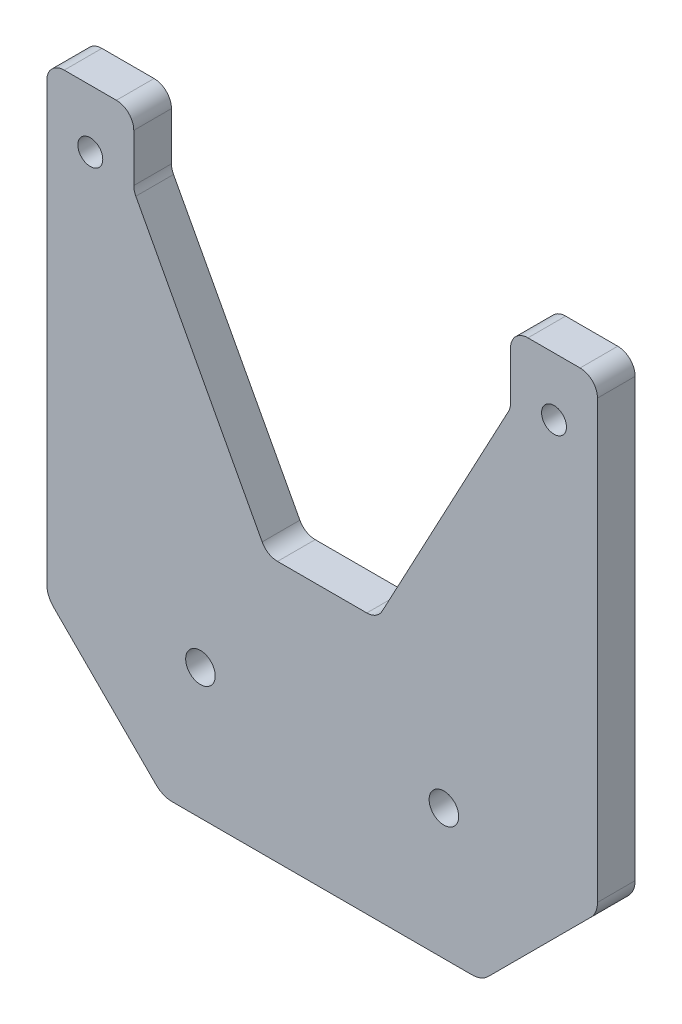
ISO-10303-21;
HEADER;
FILE_DESCRIPTION(('STEP AP214'),'2;1');
FILE_NAME('part.step','',(''),(''),'','','');
FILE_SCHEMA(('AUTOMOTIVE_DESIGN { 1 0 10303 214 1 1 1 1 }'));
ENDSEC;
DATA;
#1=APPLICATION_CONTEXT('core data for automotive mechanical design processes');
#2=APPLICATION_PROTOCOL_DEFINITION('international standard','automotive_design',2000,#1);
#3=PRODUCT_CONTEXT('',#1,'mechanical');
#4=PRODUCT('Part','Part','',(#3));
#5=PRODUCT_RELATED_PRODUCT_CATEGORY('part','',(#4));
#6=PRODUCT_DEFINITION_FORMATION('','',#4);
#7=PRODUCT_DEFINITION_CONTEXT('part definition',#1,'design');
#8=PRODUCT_DEFINITION('design','',#6,#7);
#9=PRODUCT_DEFINITION_SHAPE('','',#8);
#10=(LENGTH_UNIT() NAMED_UNIT(*) SI_UNIT(.MILLI.,.METRE.));
#11=(NAMED_UNIT(*) PLANE_ANGLE_UNIT() SI_UNIT($,.RADIAN.));
#12=(NAMED_UNIT(*) SI_UNIT($,.STERADIAN.) SOLID_ANGLE_UNIT());
#13=UNCERTAINTY_MEASURE_WITH_UNIT(LENGTH_MEASURE(1.E-05),#10,'distance_accuracy_value','');
#14=(GEOMETRIC_REPRESENTATION_CONTEXT(3) GLOBAL_UNCERTAINTY_ASSIGNED_CONTEXT((#13)) GLOBAL_UNIT_ASSIGNED_CONTEXT((#10,
#11,#12)) REPRESENTATION_CONTEXT('',''));
#15=CARTESIAN_POINT('',(0.,0.,0.));
#16=DIRECTION('',(0.,0.,1.));
#17=DIRECTION('',(1.,0.,0.));
#18=AXIS2_PLACEMENT_3D('',#15,#16,#17);
#19=CARTESIAN_POINT('',(0.,0.,6.5));
#20=DIRECTION('',(0.,1.,0.));
#21=DIRECTION('',(-1.,0.,0.));
#22=AXIS2_PLACEMENT_3D('',#19,#20,#21);
#23=PLANE('',#22);
#24=DIRECTION('',(1.,0.,0.));
#25=VECTOR('',#24,1.);
#26=CARTESIAN_POINT('',(0.,0.,6.5));
#27=LINE('',#26,#25);
#28=CARTESIAN_POINT('',(-7.70245990505025,0.,6.5));
#29=VERTEX_POINT('',#28);
#30=CARTESIAN_POINT('',(7.70245990505026,0.,6.5));
#31=VERTEX_POINT('',#30);
#32=EDGE_CURVE('E374',#29,#31,#27,.T.);
#33=ORIENTED_EDGE('',*,*,#32,.T.);
#34=DIRECTION('',(0.,0.,-1.));
#35=VECTOR('',#34,1.);
#36=CARTESIAN_POINT('',(7.70245990505026,0.,6.5));
#37=LINE('',#36,#35);
#38=CARTESIAN_POINT('',(7.70245990505026,0.,0.));
#39=VERTEX_POINT('',#38);
#40=EDGE_CURVE('E223',#31,#39,#37,.T.);
#41=ORIENTED_EDGE('',*,*,#40,.T.);
#42=DIRECTION('',(1.,0.,0.));
#43=VECTOR('',#42,1.);
#44=CARTESIAN_POINT('',(0.,0.,0.));
#45=LINE('',#44,#43);
#46=CARTESIAN_POINT('',(-7.70245990505025,0.,0.));
#47=VERTEX_POINT('',#46);
#48=EDGE_CURVE('E207',#47,#39,#45,.T.);
#49=ORIENTED_EDGE('',*,*,#48,.F.);
#50=DIRECTION('',(0.,0.,-1.));
#51=VECTOR('',#50,1.);
#52=CARTESIAN_POINT('',(-7.70245990505025,0.,6.5));
#53=LINE('',#52,#51);
#54=EDGE_CURVE('E220',#47,#29,#53,.F.);
#55=ORIENTED_EDGE('',*,*,#54,.T.);
#56=EDGE_LOOP('',(#33,#41,#49,#55));
#57=FACE_BOUND('',#56,.T.);
#58=ADVANCED_FACE('F39',(#57),#23,.T.);
#59=CARTESIAN_POINT('',(-7.38666947014298,-3.95100925147183,6.5));
#60=DIRECTION('',(0.881784641934691,0.471652250337161,0.));
#61=DIRECTION('',(-0.471652250337161,0.881784641934691,0.));
#62=AXIS2_PLACEMENT_3D('',#59,#60,#61);
#63=PLANE('',#62);
#64=DIRECTION('',(0.471652250337161,-0.881784641934692,0.));
#65=VECTOR('',#64,1.);
#66=CARTESIAN_POINT('',(-7.38666947014298,-3.95100925147183,0.));
#67=LINE('',#66,#65);
#68=CARTESIAN_POINT('',(-32.1453539258041,42.3369660351989,0.));
#69=VERTEX_POINT('',#68);
#70=CARTESIAN_POINT('',(-10.3478138308543,1.58504324898852,0.));
#71=VERTEX_POINT('',#70);
#72=EDGE_CURVE('E209',#69,#71,#67,.T.);
#73=ORIENTED_EDGE('',*,*,#72,.F.);
#74=DIRECTION('',(0.,0.,-1.));
#75=VECTOR('',#74,1.);
#76=CARTESIAN_POINT('',(-32.1453539258041,42.3369660351989,6.5));
#77=LINE('',#76,#75);
#78=CARTESIAN_POINT('',(-32.1453539258041,42.3369660351989,6.5));
#79=VERTEX_POINT('',#78);
#80=EDGE_CURVE('E277',#69,#79,#77,.F.);
#81=ORIENTED_EDGE('',*,*,#80,.T.);
#82=DIRECTION('',(0.471652250337161,-0.881784641934692,0.));
#83=VECTOR('',#82,1.);
#84=CARTESIAN_POINT('',(-7.38666947014298,-3.95100925147183,6.5));
#85=LINE('',#84,#83);
#86=CARTESIAN_POINT('',(-10.3478138308543,1.58504324898852,6.5));
#87=VERTEX_POINT('',#86);
#88=EDGE_CURVE('E377',#79,#87,#85,.T.);
#89=ORIENTED_EDGE('',*,*,#88,.T.);
#90=DIRECTION('',(0.,0.,-1.));
#91=VECTOR('',#90,1.);
#92=CARTESIAN_POINT('',(-10.3478138308543,1.58504324898852,0.));
#93=LINE('',#92,#91);
#94=EDGE_CURVE('E275',#87,#71,#93,.T.);
#95=ORIENTED_EDGE('',*,*,#94,.T.);
#96=EDGE_LOOP('',(#73,#81,#89,#95));
#97=FACE_BOUND('',#96,.T.);
#98=ADVANCED_FACE('F456',(#97),#63,.T.);
#99=CARTESIAN_POINT('',(-32.5,0.,6.5));
#100=DIRECTION('',(1.,0.,0.));
#101=DIRECTION('',(0.,1.,0.));
#102=AXIS2_PLACEMENT_3D('',#99,#100,#101);
#103=PLANE('',#102);
#104=DIRECTION('',(0.,-1.,0.));
#105=VECTOR('',#104,1.);
#106=CARTESIAN_POINT('',(-32.5,0.,6.5));
#107=LINE('',#106,#105);
#108=CARTESIAN_POINT('',(-32.5,52.,6.5));
#109=VERTEX_POINT('',#108);
#110=CARTESIAN_POINT('',(-32.5,43.7519227862104,6.5));
#111=VERTEX_POINT('',#110);
#112=EDGE_CURVE('E380',#109,#111,#107,.T.);
#113=ORIENTED_EDGE('',*,*,#112,.T.);
#114=DIRECTION('',(0.,0.,-1.));
#115=VECTOR('',#114,1.);
#116=CARTESIAN_POINT('',(-32.5,43.7519227862104,0.));
#117=LINE('',#116,#115);
#118=CARTESIAN_POINT('',(-32.5,43.7519227862104,0.));
#119=VERTEX_POINT('',#118);
#120=EDGE_CURVE('E272',#111,#119,#117,.T.);
#121=ORIENTED_EDGE('',*,*,#120,.T.);
#122=DIRECTION('',(0.,-1.,0.));
#123=VECTOR('',#122,1.);
#124=CARTESIAN_POINT('',(-32.5,0.,0.));
#125=LINE('',#124,#123);
#126=CARTESIAN_POINT('',(-32.5,52.,0.));
#127=VERTEX_POINT('',#126);
#128=EDGE_CURVE('E413',#127,#119,#125,.T.);
#129=ORIENTED_EDGE('',*,*,#128,.F.);
#130=DIRECTION('',(0.,0.,-1.));
#131=VECTOR('',#130,1.);
#132=CARTESIAN_POINT('',(-32.5,52.,6.5));
#133=LINE('',#132,#131);
#134=EDGE_CURVE('E270',#127,#109,#133,.F.);
#135=ORIENTED_EDGE('',*,*,#134,.T.);
#136=EDGE_LOOP('',(#113,#121,#129,#135));
#137=FACE_BOUND('',#136,.T.);
#138=ADVANCED_FACE('F461',(#137),#103,.T.);
#139=CARTESIAN_POINT('',(0.,55.,6.5));
#140=DIRECTION('',(0.,-1.,0.));
#141=DIRECTION('',(1.,0.,0.));
#142=AXIS2_PLACEMENT_3D('',#139,#140,#141);
#143=PLANE('',#142);
#144=DIRECTION('',(-1.,0.,0.));
#145=VECTOR('',#144,1.);
#146=CARTESIAN_POINT('',(0.,55.,0.));
#147=LINE('',#146,#145);
#148=CARTESIAN_POINT('',(-35.5,55.,0.));
#149=VERTEX_POINT('',#148);
#150=CARTESIAN_POINT('',(-44.5,55.,0.));
#151=VERTEX_POINT('',#150);
#152=EDGE_CURVE('E416',#149,#151,#147,.T.);
#153=ORIENTED_EDGE('',*,*,#152,.T.);
#154=DIRECTION('',(0.,0.,-1.));
#155=VECTOR('',#154,1.);
#156=CARTESIAN_POINT('',(-44.5,55.,6.5));
#157=LINE('',#156,#155);
#158=CARTESIAN_POINT('',(-44.5,55.,6.5));
#159=VERTEX_POINT('',#158);
#160=EDGE_CURVE('E285',#151,#159,#157,.F.);
#161=ORIENTED_EDGE('',*,*,#160,.T.);
#162=DIRECTION('',(-1.,0.,0.));
#163=VECTOR('',#162,1.);
#164=CARTESIAN_POINT('',(0.,55.,6.5));
#165=LINE('',#164,#163);
#166=CARTESIAN_POINT('',(-35.5,55.,6.5));
#167=VERTEX_POINT('',#166);
#168=EDGE_CURVE('E385',#167,#159,#165,.T.);
#169=ORIENTED_EDGE('',*,*,#168,.F.);
#170=DIRECTION('',(0.,0.,-1.));
#171=VECTOR('',#170,1.);
#172=CARTESIAN_POINT('',(-35.5,55.,0.));
#173=LINE('',#172,#171);
#174=EDGE_CURVE('E282',#167,#149,#173,.T.);
#175=ORIENTED_EDGE('',*,*,#174,.T.);
#176=EDGE_LOOP('',(#153,#161,#169,#175));
#177=FACE_BOUND('',#176,.T.);
#178=ADVANCED_FACE('F628',(#177),#143,.F.);
#179=CARTESIAN_POINT('',(-47.5,0.,6.5));
#180=DIRECTION('',(1.,0.,0.));
#181=DIRECTION('',(0.,0.,-1.));
#182=AXIS2_PLACEMENT_3D('',#179,#180,#181);
#183=PLANE('',#182);
#184=DIRECTION('',(0.,-1.,0.));
#185=VECTOR('',#184,1.);
#186=CARTESIAN_POINT('',(-47.5,0.,0.));
#187=LINE('',#186,#185);
#188=CARTESIAN_POINT('',(-47.5,52.,0.));
#189=VERTEX_POINT('',#188);
#190=CARTESIAN_POINT('',(-47.5,-23.3431457505076,0.));
#191=VERTEX_POINT('',#190);
#192=EDGE_CURVE('E355',#189,#191,#187,.T.);
#193=ORIENTED_EDGE('',*,*,#192,.T.);
#194=DIRECTION('',(0.,0.,-1.));
#195=VECTOR('',#194,1.);
#196=CARTESIAN_POINT('',(-47.5,-23.3431457505076,6.5));
#197=LINE('',#196,#195);
#198=CARTESIAN_POINT('',(-47.5,-23.3431457505076,6.5));
#199=VERTEX_POINT('',#198);
#200=EDGE_CURVE('E11',#191,#199,#197,.F.);
#201=ORIENTED_EDGE('',*,*,#200,.T.);
#202=DIRECTION('',(0.,-1.,0.));
#203=VECTOR('',#202,1.);
#204=CARTESIAN_POINT('',(-47.5,0.,6.5));
#205=LINE('',#204,#203);
#206=CARTESIAN_POINT('',(-47.5,52.,6.5));
#207=VERTEX_POINT('',#206);
#208=EDGE_CURVE('E388',#207,#199,#205,.T.);
#209=ORIENTED_EDGE('',*,*,#208,.F.);
#210=DIRECTION('',(0.,0.,-1.));
#211=VECTOR('',#210,1.);
#212=CARTESIAN_POINT('',(-47.5,52.,6.5));
#213=LINE('',#212,#211);
#214=EDGE_CURVE('E279',#207,#189,#213,.T.);
#215=ORIENTED_EDGE('',*,*,#214,.T.);
#216=EDGE_LOOP('',(#193,#201,#209,#215));
#217=FACE_BOUND('',#216,.T.);
#218=ADVANCED_FACE('F421',(#217),#183,.F.);
#219=CARTESIAN_POINT('',(0.,-45.,6.5));
#220=DIRECTION('',(0.,1.,0.));
#221=DIRECTION('',(-1.,0.,0.));
#222=AXIS2_PLACEMENT_3D('',#219,#220,#221);
#223=PLANE('',#222);
#224=DIRECTION('',(1.,0.,0.));
#225=VECTOR('',#224,1.);
#226=CARTESIAN_POINT('',(0.,-45.,6.5));
#227=LINE('',#226,#225);
#228=CARTESIAN_POINT('',(-25.8431457505076,-45.,6.5));
#229=VERTEX_POINT('',#228);
#230=CARTESIAN_POINT('',(25.8431457505076,-45.,6.5));
#231=VERTEX_POINT('',#230);
#232=EDGE_CURVE('E391',#229,#231,#227,.T.);
#233=ORIENTED_EDGE('',*,*,#232,.F.);
#234=DIRECTION('',(0.,0.,1.));
#235=VECTOR('',#234,1.);
#236=CARTESIAN_POINT('',(-25.8431457505076,-45.,0.));
#237=LINE('',#236,#235);
#238=CARTESIAN_POINT('',(-25.8431457505076,-45.,0.));
#239=VERTEX_POINT('',#238);
#240=EDGE_CURVE('E313',#229,#239,#237,.F.);
#241=ORIENTED_EDGE('',*,*,#240,.T.);
#242=DIRECTION('',(1.,0.,0.));
#243=VECTOR('',#242,1.);
#244=CARTESIAN_POINT('',(0.,-45.,0.));
#245=LINE('',#244,#243);
#246=CARTESIAN_POINT('',(25.8431457505076,-45.,0.));
#247=VERTEX_POINT('',#246);
#248=EDGE_CURVE('E350',#239,#247,#245,.T.);
#249=ORIENTED_EDGE('',*,*,#248,.T.);
#250=DIRECTION('',(0.,0.,1.));
#251=VECTOR('',#250,1.);
#252=CARTESIAN_POINT('',(25.8431457505076,-45.,6.5));
#253=LINE('',#252,#251);
#254=EDGE_CURVE('E310',#247,#231,#253,.T.);
#255=ORIENTED_EDGE('',*,*,#254,.T.);
#256=EDGE_LOOP('',(#233,#241,#249,#255));
#257=FACE_BOUND('',#256,.T.);
#258=ADVANCED_FACE('F438',(#257),#223,.F.);
#259=CARTESIAN_POINT('',(47.5,0.,6.5));
#260=DIRECTION('',(1.,0.,0.));
#261=DIRECTION('',(0.,1.,0.));
#262=AXIS2_PLACEMENT_3D('',#259,#260,#261);
#263=PLANE('',#262);
#264=DIRECTION('',(0.,-1.,0.));
#265=VECTOR('',#264,1.);
#266=CARTESIAN_POINT('',(47.5,0.,6.5));
#267=LINE('',#266,#265);
#268=CARTESIAN_POINT('',(47.5,52.,6.5));
#269=VERTEX_POINT('',#268);
#270=CARTESIAN_POINT('',(47.5,-23.3431457505076,6.5));
#271=VERTEX_POINT('',#270);
#272=EDGE_CURVE('E345',#269,#271,#267,.T.);
#273=ORIENTED_EDGE('',*,*,#272,.T.);
#274=DIRECTION('',(0.,0.,-1.));
#275=VECTOR('',#274,1.);
#276=CARTESIAN_POINT('',(47.5,-23.3431457505076,6.5));
#277=LINE('',#276,#275);
#278=CARTESIAN_POINT('',(47.5,-23.3431457505076,0.));
#279=VERTEX_POINT('',#278);
#280=EDGE_CURVE('E47',#271,#279,#277,.T.);
#281=ORIENTED_EDGE('',*,*,#280,.T.);
#282=DIRECTION('',(0.,-1.,0.));
#283=VECTOR('',#282,1.);
#284=CARTESIAN_POINT('',(47.5,0.,0.));
#285=LINE('',#284,#283);
#286=CARTESIAN_POINT('',(47.5,52.,0.));
#287=VERTEX_POINT('',#286);
#288=EDGE_CURVE('E343',#287,#279,#285,.T.);
#289=ORIENTED_EDGE('',*,*,#288,.F.);
#290=DIRECTION('',(0.,0.,-1.));
#291=VECTOR('',#290,1.);
#292=CARTESIAN_POINT('',(47.5,52.,6.5));
#293=LINE('',#292,#291);
#294=EDGE_CURVE('E268',#287,#269,#293,.F.);
#295=ORIENTED_EDGE('',*,*,#294,.T.);
#296=EDGE_LOOP('',(#273,#281,#289,#295));
#297=FACE_BOUND('',#296,.T.);
#298=ADVANCED_FACE('F342',(#297),#263,.T.);
#299=CARTESIAN_POINT('',(0.,54.9999999999999,6.5));
#300=DIRECTION('',(0.,1.,0.));
#301=DIRECTION('',(-1.,0.,0.));
#302=AXIS2_PLACEMENT_3D('',#299,#300,#301);
#303=PLANE('',#302);
#304=DIRECTION('',(1.,0.,0.));
#305=VECTOR('',#304,1.);
#306=CARTESIAN_POINT('',(0.,54.9999999999999,0.));
#307=LINE('',#306,#305);
#308=CARTESIAN_POINT('',(35.5,55.,0.));
#309=VERTEX_POINT('',#308);
#310=CARTESIAN_POINT('',(44.5,55.,0.));
#311=VERTEX_POINT('',#310);
#312=EDGE_CURVE('E349',#309,#311,#307,.T.);
#313=ORIENTED_EDGE('',*,*,#312,.F.);
#314=DIRECTION('',(0.,0.,-1.));
#315=VECTOR('',#314,1.);
#316=CARTESIAN_POINT('',(35.5,55.,6.5));
#317=LINE('',#316,#315);
#318=CARTESIAN_POINT('',(35.5,55.,6.5));
#319=VERTEX_POINT('',#318);
#320=EDGE_CURVE('E258',#309,#319,#317,.F.);
#321=ORIENTED_EDGE('',*,*,#320,.T.);
#322=DIRECTION('',(1.,0.,0.));
#323=VECTOR('',#322,1.);
#324=CARTESIAN_POINT('',(0.,54.9999999999999,6.5));
#325=LINE('',#324,#323);
#326=CARTESIAN_POINT('',(44.5,55.,6.5));
#327=VERTEX_POINT('',#326);
#328=EDGE_CURVE('E395',#319,#327,#325,.T.);
#329=ORIENTED_EDGE('',*,*,#328,.T.);
#330=DIRECTION('',(0.,0.,-1.));
#331=VECTOR('',#330,1.);
#332=CARTESIAN_POINT('',(44.5,55.,6.5));
#333=LINE('',#332,#331);
#334=EDGE_CURVE('E255',#327,#311,#333,.T.);
#335=ORIENTED_EDGE('',*,*,#334,.T.);
#336=EDGE_LOOP('',(#313,#321,#329,#335));
#337=FACE_BOUND('',#336,.T.);
#338=ADVANCED_FACE('F611',(#337),#303,.T.);
#339=CARTESIAN_POINT('',(32.5,0.,6.5));
#340=DIRECTION('',(1.,0.,0.));
#341=DIRECTION('',(0.,1.,0.));
#342=AXIS2_PLACEMENT_3D('',#339,#340,#341);
#343=PLANE('',#342);
#344=DIRECTION('',(0.,-1.,0.));
#345=VECTOR('',#344,1.);
#346=CARTESIAN_POINT('',(32.5,0.,0.));
#347=LINE('',#346,#345);
#348=CARTESIAN_POINT('',(32.5,52.,0.));
#349=VERTEX_POINT('',#348);
#350=CARTESIAN_POINT('',(32.5,43.7519227862104,0.));
#351=VERTEX_POINT('',#350);
#352=EDGE_CURVE('E352',#349,#351,#347,.T.);
#353=ORIENTED_EDGE('',*,*,#352,.T.);
#354=DIRECTION('',(0.,0.,-1.));
#355=VECTOR('',#354,1.);
#356=CARTESIAN_POINT('',(32.5,43.7519227862104,6.5));
#357=LINE('',#356,#355);
#358=CARTESIAN_POINT('',(32.5,43.7519227862104,6.5));
#359=VERTEX_POINT('',#358);
#360=EDGE_CURVE('E245',#351,#359,#357,.F.);
#361=ORIENTED_EDGE('',*,*,#360,.T.);
#362=DIRECTION('',(0.,-1.,0.));
#363=VECTOR('',#362,1.);
#364=CARTESIAN_POINT('',(32.5,0.,6.5));
#365=LINE('',#364,#363);
#366=CARTESIAN_POINT('',(32.5,52.,6.5));
#367=VERTEX_POINT('',#366);
#368=EDGE_CURVE('E398',#367,#359,#365,.T.);
#369=ORIENTED_EDGE('',*,*,#368,.F.);
#370=DIRECTION('',(0.,0.,-1.));
#371=VECTOR('',#370,1.);
#372=CARTESIAN_POINT('',(32.5,52.,0.));
#373=LINE('',#372,#371);
#374=EDGE_CURVE('E242',#367,#349,#373,.T.);
#375=ORIENTED_EDGE('',*,*,#374,.T.);
#376=EDGE_LOOP('',(#353,#361,#369,#375));
#377=FACE_BOUND('',#376,.T.);
#378=ADVANCED_FACE('F694',(#377),#343,.F.);
#379=CARTESIAN_POINT('',(21.,-22.5,6.5));
#380=DIRECTION('',(0.,0.,-1.));
#381=DIRECTION('',(-1.,0.,0.));
#382=AXIS2_PLACEMENT_3D('',#379,#380,#381);
#383=CYLINDRICAL_SURFACE('',#382,2.55);
#384=CARTESIAN_POINT('',(21.,-22.5,6.5));
#385=DIRECTION('',(0.,0.,1.));
#386=DIRECTION('',(1.,0.,0.));
#387=AXIS2_PLACEMENT_3D('',#384,#385,#386);
#388=CIRCLE('',#387,2.55);
#389=CARTESIAN_POINT('',(23.55,-22.5,6.5));
#390=VERTEX_POINT('',#389);
#391=EDGE_CURVE('E232',#390,#390,#388,.F.);
#392=ORIENTED_EDGE('',*,*,#391,.F.);
#393=EDGE_LOOP('',(#392));
#394=FACE_BOUND('',#393,.T.);
#395=CARTESIAN_POINT('',(21.,-22.5,0.));
#396=DIRECTION('',(0.,0.,1.));
#397=DIRECTION('',(1.,0.,0.));
#398=AXIS2_PLACEMENT_3D('',#395,#396,#397);
#399=CIRCLE('',#398,2.55);
#400=CARTESIAN_POINT('',(23.55,-22.5,0.));
#401=VERTEX_POINT('',#400);
#402=EDGE_CURVE('E369',#401,#401,#399,.F.);
#403=ORIENTED_EDGE('',*,*,#402,.T.);
#404=EDGE_LOOP('',(#403));
#405=FACE_BOUND('',#404,.T.);
#406=ADVANCED_FACE('F685',(#394,#405),#383,.F.);
#407=CARTESIAN_POINT('',(-21.,-22.5,6.5));
#408=DIRECTION('',(0.,0.,-1.));
#409=DIRECTION('',(-1.,0.,0.));
#410=AXIS2_PLACEMENT_3D('',#407,#408,#409);
#411=CYLINDRICAL_SURFACE('',#410,2.55);
#412=CARTESIAN_POINT('',(-21.,-22.5,6.5));
#413=DIRECTION('',(0.,0.,1.));
#414=DIRECTION('',(1.,0.,0.));
#415=AXIS2_PLACEMENT_3D('',#412,#413,#414);
#416=CIRCLE('',#415,2.55);
#417=CARTESIAN_POINT('',(-18.45,-22.5,6.5));
#418=VERTEX_POINT('',#417);
#419=EDGE_CURVE('E407',#418,#418,#416,.T.);
#420=ORIENTED_EDGE('',*,*,#419,.T.);
#421=EDGE_LOOP('',(#420));
#422=FACE_BOUND('',#421,.T.);
#423=CARTESIAN_POINT('',(-21.,-22.5,0.));
#424=DIRECTION('',(0.,0.,1.));
#425=DIRECTION('',(1.,0.,0.));
#426=AXIS2_PLACEMENT_3D('',#423,#424,#425);
#427=CIRCLE('',#426,2.55);
#428=CARTESIAN_POINT('',(-18.45,-22.5,0.));
#429=VERTEX_POINT('',#428);
#430=EDGE_CURVE('E367',#429,#429,#427,.T.);
#431=ORIENTED_EDGE('',*,*,#430,.F.);
#432=EDGE_LOOP('',(#431));
#433=FACE_BOUND('',#432,.T.);
#434=ADVANCED_FACE('F675',(#422,#433),#411,.F.);
#435=CARTESIAN_POINT('',(-40.,45.,6.5));
#436=DIRECTION('',(0.,0.,-1.));
#437=DIRECTION('',(-1.,0.,0.));
#438=AXIS2_PLACEMENT_3D('',#435,#436,#437);
#439=CYLINDRICAL_SURFACE('',#438,2.15);
#440=CARTESIAN_POINT('',(-40.,45.,6.5));
#441=DIRECTION('',(0.,0.,1.));
#442=DIRECTION('',(1.,0.,0.));
#443=AXIS2_PLACEMENT_3D('',#440,#441,#442);
#444=CIRCLE('',#443,2.15);
#445=CARTESIAN_POINT('',(-37.85,45.,6.5));
#446=VERTEX_POINT('',#445);
#447=EDGE_CURVE('E404',#446,#446,#444,.T.);
#448=ORIENTED_EDGE('',*,*,#447,.T.);
#449=EDGE_LOOP('',(#448));
#450=FACE_BOUND('',#449,.T.);
#451=CARTESIAN_POINT('',(-40.,45.,0.));
#452=DIRECTION('',(0.,0.,1.));
#453=DIRECTION('',(1.,0.,0.));
#454=AXIS2_PLACEMENT_3D('',#451,#452,#453);
#455=CIRCLE('',#454,2.15);
#456=CARTESIAN_POINT('',(-37.85,45.,0.));
#457=VERTEX_POINT('',#456);
#458=EDGE_CURVE('E364',#457,#457,#455,.T.);
#459=ORIENTED_EDGE('',*,*,#458,.F.);
#460=EDGE_LOOP('',(#459));
#461=FACE_BOUND('',#460,.T.);
#462=ADVANCED_FACE('F670',(#450,#461),#439,.F.);
#463=CARTESIAN_POINT('',(7.38666947014299,-3.95100925147183,6.5));
#464=DIRECTION('',(0.881784641934692,-0.471652250337161,0.));
#465=DIRECTION('',(0.471652250337161,0.881784641934692,0.));
#466=AXIS2_PLACEMENT_3D('',#463,#464,#465);
#467=PLANE('',#466);
#468=DIRECTION('',(-0.471652250337161,-0.881784641934692,0.));
#469=VECTOR('',#468,1.);
#470=CARTESIAN_POINT('',(7.38666947014299,-3.95100925147183,0.));
#471=LINE('',#470,#469);
#472=CARTESIAN_POINT('',(32.1453539258041,42.3369660351989,0.));
#473=VERTEX_POINT('',#472);
#474=CARTESIAN_POINT('',(10.3478138308543,1.58504324898852,0.));
#475=VERTEX_POINT('',#474);
#476=EDGE_CURVE('E361',#473,#475,#471,.T.);
#477=ORIENTED_EDGE('',*,*,#476,.T.);
#478=DIRECTION('',(0.,0.,-1.));
#479=VECTOR('',#478,1.);
#480=CARTESIAN_POINT('',(10.3478138308543,1.58504324898852,6.5));
#481=LINE('',#480,#479);
#482=CARTESIAN_POINT('',(10.3478138308543,1.58504324898852,6.5));
#483=VERTEX_POINT('',#482);
#484=EDGE_CURVE('E240',#475,#483,#481,.F.);
#485=ORIENTED_EDGE('',*,*,#484,.T.);
#486=DIRECTION('',(-0.471652250337161,-0.881784641934692,0.));
#487=VECTOR('',#486,1.);
#488=CARTESIAN_POINT('',(7.38666947014299,-3.95100925147183,6.5));
#489=LINE('',#488,#487);
#490=CARTESIAN_POINT('',(32.1453539258041,42.3369660351989,6.5));
#491=VERTEX_POINT('',#490);
#492=EDGE_CURVE('E401',#491,#483,#489,.T.);
#493=ORIENTED_EDGE('',*,*,#492,.F.);
#494=DIRECTION('',(0.,0.,-1.));
#495=VECTOR('',#494,1.);
#496=CARTESIAN_POINT('',(32.1453539258041,42.3369660351989,0.));
#497=LINE('',#496,#495);
#498=EDGE_CURVE('E229',#491,#473,#497,.T.);
#499=ORIENTED_EDGE('',*,*,#498,.T.);
#500=EDGE_LOOP('',(#477,#485,#493,#499));
#501=FACE_BOUND('',#500,.T.);
#502=ADVANCED_FACE('F661',(#501),#467,.F.);
#503=CARTESIAN_POINT('',(40.,45.,6.5));
#504=DIRECTION('',(0.,0.,-1.));
#505=DIRECTION('',(-1.,0.,0.));
#506=AXIS2_PLACEMENT_3D('',#503,#504,#505);
#507=CYLINDRICAL_SURFACE('',#506,2.15);
#508=CARTESIAN_POINT('',(40.,45.,6.5));
#509=DIRECTION('',(0.,0.,1.));
#510=DIRECTION('',(1.,0.,0.));
#511=AXIS2_PLACEMENT_3D('',#508,#509,#510);
#512=CIRCLE('',#511,2.15);
#513=CARTESIAN_POINT('',(42.15,45.,6.5));
#514=VERTEX_POINT('',#513);
#515=EDGE_CURVE('E227',#514,#514,#512,.F.);
#516=ORIENTED_EDGE('',*,*,#515,.F.);
#517=EDGE_LOOP('',(#516));
#518=FACE_BOUND('',#517,.T.);
#519=CARTESIAN_POINT('',(40.,45.,0.));
#520=DIRECTION('',(0.,0.,1.));
#521=DIRECTION('',(1.,0.,0.));
#522=AXIS2_PLACEMENT_3D('',#519,#520,#521);
#523=CIRCLE('',#522,2.15);
#524=CARTESIAN_POINT('',(42.15,45.,0.));
#525=VERTEX_POINT('',#524);
#526=EDGE_CURVE('E235',#525,#525,#523,.F.);
#527=ORIENTED_EDGE('',*,*,#526,.T.);
#528=EDGE_LOOP('',(#527));
#529=FACE_BOUND('',#528,.T.);
#530=ADVANCED_FACE('F599',(#518,#529),#507,.F.);
#531=CARTESIAN_POINT('',(0.,0.,6.5));
#532=DIRECTION('',(0.,0.,1.));
#533=DIRECTION('',(1.,0.,0.));
#534=AXIS2_PLACEMENT_3D('',#531,#532,#533);
#535=PLANE('',#534);
#536=DIRECTION('',(-0.707106781186547,0.707106781186549,0.));
#537=VECTOR('',#536,1.);
#538=CARTESIAN_POINT('',(-36.25,-36.25,6.5));
#539=LINE('',#538,#537);
#540=CARTESIAN_POINT('',(-46.3284271247462,-26.1715728752538,6.5));
#541=VERTEX_POINT('',#540);
#542=CARTESIAN_POINT('',(-28.6715728752538,-43.8284271247462,6.5));
#543=VERTEX_POINT('',#542);
#544=EDGE_CURVE('E305',#541,#543,#539,.F.);
#545=ORIENTED_EDGE('',*,*,#544,.T.);
#546=CARTESIAN_POINT('',(-25.8431457505076,-41.,6.5));
#547=DIRECTION('',(0.,0.,1.));
#548=DIRECTION('',(1.,0.,0.));
#549=AXIS2_PLACEMENT_3D('',#546,#547,#548);
#550=CIRCLE('',#549,4.);
#551=EDGE_CURVE('E332',#543,#229,#550,.T.);
#552=ORIENTED_EDGE('',*,*,#551,.T.);
#553=ORIENTED_EDGE('',*,*,#232,.T.);
#554=CARTESIAN_POINT('',(25.8431457505076,-41.,6.5));
#555=DIRECTION('',(0.,0.,1.));
#556=DIRECTION('',(1.,0.,0.));
#557=AXIS2_PLACEMENT_3D('',#554,#555,#556);
#558=CIRCLE('',#557,4.);
#559=CARTESIAN_POINT('',(28.6715728752538,-43.8284271247462,6.5));
#560=VERTEX_POINT('',#559);
#561=EDGE_CURVE('E330',#231,#560,#558,.T.);
#562=ORIENTED_EDGE('',*,*,#561,.T.);
#563=DIRECTION('',(0.707106781186549,0.707106781186546,0.));
#564=VECTOR('',#563,1.);
#565=CARTESIAN_POINT('',(36.2499999999999,-36.2500000000001,6.5));
#566=LINE('',#565,#564);
#567=CARTESIAN_POINT('',(46.3284271247462,-26.1715728752538,6.5));
#568=VERTEX_POINT('',#567);
#569=EDGE_CURVE('E308',#560,#568,#566,.T.);
#570=ORIENTED_EDGE('',*,*,#569,.T.);
#571=CARTESIAN_POINT('',(43.5,-23.3431457505076,6.5));
#572=DIRECTION('',(0.,0.,1.));
#573=DIRECTION('',(1.,0.,0.));
#574=AXIS2_PLACEMENT_3D('',#571,#572,#573);
#575=CIRCLE('',#574,4.);
#576=EDGE_CURVE('E61',#568,#271,#575,.T.);
#577=ORIENTED_EDGE('',*,*,#576,.T.);
#578=ORIENTED_EDGE('',*,*,#272,.F.);
#579=CARTESIAN_POINT('',(44.5,52.,6.5));
#580=DIRECTION('',(0.,0.,1.));
#581=DIRECTION('',(1.,0.,0.));
#582=AXIS2_PLACEMENT_3D('',#579,#580,#581);
#583=CIRCLE('',#582,3.);
#584=EDGE_CURVE('E264',#269,#327,#583,.T.);
#585=ORIENTED_EDGE('',*,*,#584,.T.);
#586=ORIENTED_EDGE('',*,*,#328,.F.);
#587=CARTESIAN_POINT('',(35.5,52.,6.5));
#588=DIRECTION('',(0.,0.,1.));
#589=DIRECTION('',(1.,0.,0.));
#590=AXIS2_PLACEMENT_3D('',#587,#588,#589);
#591=CIRCLE('',#590,3.);
#592=EDGE_CURVE('E266',#319,#367,#591,.T.);
#593=ORIENTED_EDGE('',*,*,#592,.T.);
#594=ORIENTED_EDGE('',*,*,#368,.T.);
#595=CARTESIAN_POINT('',(29.5,43.7519227862104,6.5));
#596=DIRECTION('',(0.,0.,1.));
#597=DIRECTION('',(1.,0.,0.));
#598=AXIS2_PLACEMENT_3D('',#595,#596,#597);
#599=CIRCLE('',#598,3.);
#600=EDGE_CURVE('E293',#359,#491,#599,.F.);
#601=ORIENTED_EDGE('',*,*,#600,.T.);
#602=ORIENTED_EDGE('',*,*,#492,.T.);
#603=CARTESIAN_POINT('',(7.70245990505026,3.,6.5));
#604=DIRECTION('',(0.,0.,1.));
#605=DIRECTION('',(1.,0.,0.));
#606=AXIS2_PLACEMENT_3D('',#603,#604,#605);
#607=CIRCLE('',#606,3.);
#608=EDGE_CURVE('E289',#483,#31,#607,.F.);
#609=ORIENTED_EDGE('',*,*,#608,.T.);
#610=ORIENTED_EDGE('',*,*,#32,.F.);
#611=CARTESIAN_POINT('',(-7.70245990505025,3.,6.5));
#612=DIRECTION('',(0.,0.,1.));
#613=DIRECTION('',(1.,0.,0.));
#614=AXIS2_PLACEMENT_3D('',#611,#612,#613);
#615=CIRCLE('',#614,3.);
#616=EDGE_CURVE('E214',#29,#87,#615,.F.);
#617=ORIENTED_EDGE('',*,*,#616,.T.);
#618=ORIENTED_EDGE('',*,*,#88,.F.);
#619=CARTESIAN_POINT('',(-29.5,43.7519227862104,6.5));
#620=DIRECTION('',(0.,0.,1.));
#621=DIRECTION('',(1.,0.,0.));
#622=AXIS2_PLACEMENT_3D('',#619,#620,#621);
#623=CIRCLE('',#622,3.);
#624=EDGE_CURVE('E215',#79,#111,#623,.F.);
#625=ORIENTED_EDGE('',*,*,#624,.T.);
#626=ORIENTED_EDGE('',*,*,#112,.F.);
#627=CARTESIAN_POINT('',(-35.5,52.,6.5));
#628=DIRECTION('',(0.,0.,1.));
#629=DIRECTION('',(1.,0.,0.));
#630=AXIS2_PLACEMENT_3D('',#627,#628,#629);
#631=CIRCLE('',#630,3.);
#632=EDGE_CURVE('E260',#109,#167,#631,.T.);
#633=ORIENTED_EDGE('',*,*,#632,.T.);
#634=ORIENTED_EDGE('',*,*,#168,.T.);
#635=CARTESIAN_POINT('',(-44.5,52.,6.5));
#636=DIRECTION('',(0.,0.,1.));
#637=DIRECTION('',(1.,0.,0.));
#638=AXIS2_PLACEMENT_3D('',#635,#636,#637);
#639=CIRCLE('',#638,3.);
#640=EDGE_CURVE('E262',#159,#207,#639,.T.);
#641=ORIENTED_EDGE('',*,*,#640,.T.);
#642=ORIENTED_EDGE('',*,*,#208,.T.);
#643=CARTESIAN_POINT('',(-43.5,-23.3431457505076,6.5));
#644=DIRECTION('',(0.,0.,1.));
#645=DIRECTION('',(1.,0.,0.));
#646=AXIS2_PLACEMENT_3D('',#643,#644,#645);
#647=CIRCLE('',#646,4.);
#648=EDGE_CURVE('E54',#199,#541,#647,.T.);
#649=ORIENTED_EDGE('',*,*,#648,.T.);
#650=EDGE_LOOP('',(#545,#552,#553,#562,#570,#577,#578,#585,#586,#593,#594,#601,#602,#609,#610,
#617,#618,#625,#626,#633,#634,#641,#642,#649));
#651=FACE_BOUND('',#650,.T.);
#652=ORIENTED_EDGE('',*,*,#447,.F.);
#653=EDGE_LOOP('',(#652));
#654=FACE_BOUND('',#653,.T.);
#655=ORIENTED_EDGE('',*,*,#419,.F.);
#656=EDGE_LOOP('',(#655));
#657=FACE_BOUND('',#656,.T.);
#658=ORIENTED_EDGE('',*,*,#391,.T.);
#659=EDGE_LOOP('',(#658));
#660=FACE_BOUND('',#659,.T.);
#661=ORIENTED_EDGE('',*,*,#515,.T.);
#662=EDGE_LOOP('',(#661));
#663=FACE_BOUND('',#662,.T.);
#664=ADVANCED_FACE('F435',(#651,#654,#657,#660,#663),#535,.T.);
#665=CARTESIAN_POINT('',(0.,0.,0.));
#666=DIRECTION('',(0.,0.,1.));
#667=DIRECTION('',(1.,0.,0.));
#668=AXIS2_PLACEMENT_3D('',#665,#666,#667);
#669=PLANE('',#668);
#670=ORIENTED_EDGE('',*,*,#248,.F.);
#671=CARTESIAN_POINT('',(-25.8431457505076,-41.,0.));
#672=DIRECTION('',(0.,0.,1.));
#673=DIRECTION('',(1.,0.,0.));
#674=AXIS2_PLACEMENT_3D('',#671,#672,#673);
#675=CIRCLE('',#674,4.);
#676=CARTESIAN_POINT('',(-28.6715728752538,-43.8284271247462,0.));
#677=VERTEX_POINT('',#676);
#678=EDGE_CURVE('E322',#239,#677,#675,.F.);
#679=ORIENTED_EDGE('',*,*,#678,.T.);
#680=DIRECTION('',(0.707106781186547,-0.707106781186549,0.));
#681=VECTOR('',#680,1.);
#682=CARTESIAN_POINT('',(-27.5,-45.,0.));
#683=LINE('',#682,#681);
#684=CARTESIAN_POINT('',(-46.3284271247462,-26.1715728752537,0.));
#685=VERTEX_POINT('',#684);
#686=EDGE_CURVE('E299',#677,#685,#683,.F.);
#687=ORIENTED_EDGE('',*,*,#686,.T.);
#688=CARTESIAN_POINT('',(-43.5,-23.3431457505076,0.));
#689=DIRECTION('',(0.,0.,1.));
#690=DIRECTION('',(1.,0.,0.));
#691=AXIS2_PLACEMENT_3D('',#688,#689,#690);
#692=CIRCLE('',#691,4.);
#693=EDGE_CURVE('E316',#685,#191,#692,.F.);
#694=ORIENTED_EDGE('',*,*,#693,.T.);
#695=ORIENTED_EDGE('',*,*,#192,.F.);
#696=CARTESIAN_POINT('',(-44.5,52.,0.));
#697=DIRECTION('',(0.,0.,1.));
#698=DIRECTION('',(1.,0.,0.));
#699=AXIS2_PLACEMENT_3D('',#696,#697,#698);
#700=CIRCLE('',#699,3.);
#701=EDGE_CURVE('E249',#189,#151,#700,.F.);
#702=ORIENTED_EDGE('',*,*,#701,.T.);
#703=ORIENTED_EDGE('',*,*,#152,.F.);
#704=CARTESIAN_POINT('',(-35.5,52.,0.));
#705=DIRECTION('',(0.,0.,1.));
#706=DIRECTION('',(1.,0.,0.));
#707=AXIS2_PLACEMENT_3D('',#704,#705,#706);
#708=CIRCLE('',#707,3.);
#709=EDGE_CURVE('E247',#149,#127,#708,.F.);
#710=ORIENTED_EDGE('',*,*,#709,.T.);
#711=ORIENTED_EDGE('',*,*,#128,.T.);
#712=CARTESIAN_POINT('',(-29.5,43.7519227862104,0.));
#713=DIRECTION('',(0.,0.,1.));
#714=DIRECTION('',(1.,0.,0.));
#715=AXIS2_PLACEMENT_3D('',#712,#713,#714);
#716=CIRCLE('',#715,3.);
#717=EDGE_CURVE('E295',#119,#69,#716,.T.);
#718=ORIENTED_EDGE('',*,*,#717,.T.);
#719=ORIENTED_EDGE('',*,*,#72,.T.);
#720=CARTESIAN_POINT('',(-7.70245990505025,3.,0.));
#721=DIRECTION('',(0.,0.,1.));
#722=DIRECTION('',(1.,0.,0.));
#723=AXIS2_PLACEMENT_3D('',#720,#721,#722);
#724=CIRCLE('',#723,3.);
#725=EDGE_CURVE('E202',#71,#47,#724,.T.);
#726=ORIENTED_EDGE('',*,*,#725,.T.);
#727=ORIENTED_EDGE('',*,*,#48,.T.);
#728=CARTESIAN_POINT('',(7.70245990505026,3.,0.));
#729=DIRECTION('',(0.,0.,1.));
#730=DIRECTION('',(1.,0.,0.));
#731=AXIS2_PLACEMENT_3D('',#728,#729,#730);
#732=CIRCLE('',#731,3.);
#733=EDGE_CURVE('E287',#39,#475,#732,.T.);
#734=ORIENTED_EDGE('',*,*,#733,.T.);
#735=ORIENTED_EDGE('',*,*,#476,.F.);
#736=CARTESIAN_POINT('',(29.5,43.7519227862104,0.));
#737=DIRECTION('',(0.,0.,1.));
#738=DIRECTION('',(1.,0.,0.));
#739=AXIS2_PLACEMENT_3D('',#736,#737,#738);
#740=CIRCLE('',#739,3.);
#741=EDGE_CURVE('E291',#473,#351,#740,.T.);
#742=ORIENTED_EDGE('',*,*,#741,.T.);
#743=ORIENTED_EDGE('',*,*,#352,.F.);
#744=CARTESIAN_POINT('',(35.5,52.,0.));
#745=DIRECTION('',(0.,0.,1.));
#746=DIRECTION('',(1.,0.,0.));
#747=AXIS2_PLACEMENT_3D('',#744,#745,#746);
#748=CIRCLE('',#747,3.);
#749=EDGE_CURVE('E253',#349,#309,#748,.F.);
#750=ORIENTED_EDGE('',*,*,#749,.T.);
#751=ORIENTED_EDGE('',*,*,#312,.T.);
#752=CARTESIAN_POINT('',(44.5,52.,0.));
#753=DIRECTION('',(0.,0.,1.));
#754=DIRECTION('',(1.,0.,0.));
#755=AXIS2_PLACEMENT_3D('',#752,#753,#754);
#756=CIRCLE('',#755,3.);
#757=EDGE_CURVE('E251',#311,#287,#756,.F.);
#758=ORIENTED_EDGE('',*,*,#757,.T.);
#759=ORIENTED_EDGE('',*,*,#288,.T.);
#760=CARTESIAN_POINT('',(43.5,-23.3431457505076,0.));
#761=DIRECTION('',(0.,0.,1.));
#762=DIRECTION('',(1.,0.,0.));
#763=AXIS2_PLACEMENT_3D('',#760,#761,#762);
#764=CIRCLE('',#763,4.);
#765=CARTESIAN_POINT('',(46.3284271247462,-26.1715728752538,0.));
#766=VERTEX_POINT('',#765);
#767=EDGE_CURVE('E318',#279,#766,#764,.F.);
#768=ORIENTED_EDGE('',*,*,#767,.T.);
#769=DIRECTION('',(-0.707106781186549,-0.707106781186546,0.));
#770=VECTOR('',#769,1.);
#771=CARTESIAN_POINT('',(47.5,-25.,0.));
#772=LINE('',#771,#770);
#773=CARTESIAN_POINT('',(28.6715728752538,-43.8284271247462,0.));
#774=VERTEX_POINT('',#773);
#775=EDGE_CURVE('E302',#766,#774,#772,.T.);
#776=ORIENTED_EDGE('',*,*,#775,.T.);
#777=CARTESIAN_POINT('',(25.8431457505076,-41.,0.));
#778=DIRECTION('',(0.,0.,1.));
#779=DIRECTION('',(1.,0.,0.));
#780=AXIS2_PLACEMENT_3D('',#777,#778,#779);
#781=CIRCLE('',#780,4.);
#782=EDGE_CURVE('E320',#774,#247,#781,.F.);
#783=ORIENTED_EDGE('',*,*,#782,.T.);
#784=EDGE_LOOP('',(#670,#679,#687,#694,#695,#702,#703,#710,#711,#718,#719,#726,#727,#734,#735,
#742,#743,#750,#751,#758,#759,#768,#776,#783));
#785=FACE_BOUND('',#784,.T.);
#786=ORIENTED_EDGE('',*,*,#458,.T.);
#787=EDGE_LOOP('',(#786));
#788=FACE_BOUND('',#787,.T.);
#789=ORIENTED_EDGE('',*,*,#430,.T.);
#790=EDGE_LOOP('',(#789));
#791=FACE_BOUND('',#790,.T.);
#792=ORIENTED_EDGE('',*,*,#402,.F.);
#793=EDGE_LOOP('',(#792));
#794=FACE_BOUND('',#793,.T.);
#795=ORIENTED_EDGE('',*,*,#526,.F.);
#796=EDGE_LOOP('',(#795));
#797=FACE_BOUND('',#796,.T.);
#798=ADVANCED_FACE('F205',(#785,#788,#791,#794,#797),#669,.F.);
#799=CARTESIAN_POINT('',(7.70245990505026,3.,6.5));
#800=DIRECTION('',(0.,0.,-1.));
#801=DIRECTION('',(-1.,0.,0.));
#802=AXIS2_PLACEMENT_3D('',#799,#800,#801);
#803=CYLINDRICAL_SURFACE('',#802,3.);
#804=ORIENTED_EDGE('',*,*,#608,.F.);
#805=ORIENTED_EDGE('',*,*,#484,.F.);
#806=ORIENTED_EDGE('',*,*,#733,.F.);
#807=ORIENTED_EDGE('',*,*,#40,.F.);
#808=EDGE_LOOP('',(#804,#805,#806,#807));
#809=FACE_BOUND('',#808,.T.);
#810=ADVANCED_FACE('F466',(#809),#803,.F.);
#811=CARTESIAN_POINT('',(29.5,43.7519227862104,6.5));
#812=DIRECTION('',(0.,0.,1.));
#813=DIRECTION('',(1.,0.,0.));
#814=AXIS2_PLACEMENT_3D('',#811,#812,#813);
#815=CYLINDRICAL_SURFACE('',#814,3.);
#816=ORIENTED_EDGE('',*,*,#600,.F.);
#817=ORIENTED_EDGE('',*,*,#360,.F.);
#818=ORIENTED_EDGE('',*,*,#741,.F.);
#819=ORIENTED_EDGE('',*,*,#498,.F.);
#820=EDGE_LOOP('',(#816,#817,#818,#819));
#821=FACE_BOUND('',#820,.T.);
#822=ADVANCED_FACE('F469',(#821),#815,.F.);
#823=CARTESIAN_POINT('',(35.5,52.,6.5));
#824=DIRECTION('',(0.,0.,1.));
#825=DIRECTION('',(1.,0.,0.));
#826=AXIS2_PLACEMENT_3D('',#823,#824,#825);
#827=CYLINDRICAL_SURFACE('',#826,3.);
#828=ORIENTED_EDGE('',*,*,#592,.F.);
#829=ORIENTED_EDGE('',*,*,#320,.F.);
#830=ORIENTED_EDGE('',*,*,#749,.F.);
#831=ORIENTED_EDGE('',*,*,#374,.F.);
#832=EDGE_LOOP('',(#828,#829,#830,#831));
#833=FACE_BOUND('',#832,.T.);
#834=ADVANCED_FACE('F473',(#833),#827,.T.);
#835=CARTESIAN_POINT('',(44.5,52.,6.5));
#836=DIRECTION('',(0.,0.,-1.));
#837=DIRECTION('',(-1.,0.,0.));
#838=AXIS2_PLACEMENT_3D('',#835,#836,#837);
#839=CYLINDRICAL_SURFACE('',#838,3.);
#840=ORIENTED_EDGE('',*,*,#584,.F.);
#841=ORIENTED_EDGE('',*,*,#294,.F.);
#842=ORIENTED_EDGE('',*,*,#757,.F.);
#843=ORIENTED_EDGE('',*,*,#334,.F.);
#844=EDGE_LOOP('',(#840,#841,#842,#843));
#845=FACE_BOUND('',#844,.T.);
#846=ADVANCED_FACE('F477',(#845),#839,.T.);
#847=CARTESIAN_POINT('',(-29.5,43.7519227862104,6.5));
#848=DIRECTION('',(0.,0.,1.));
#849=DIRECTION('',(1.,0.,0.));
#850=AXIS2_PLACEMENT_3D('',#847,#848,#849);
#851=CYLINDRICAL_SURFACE('',#850,3.);
#852=ORIENTED_EDGE('',*,*,#624,.F.);
#853=ORIENTED_EDGE('',*,*,#80,.F.);
#854=ORIENTED_EDGE('',*,*,#717,.F.);
#855=ORIENTED_EDGE('',*,*,#120,.F.);
#856=EDGE_LOOP('',(#852,#853,#854,#855));
#857=FACE_BOUND('',#856,.T.);
#858=ADVANCED_FACE('F481',(#857),#851,.F.);
#859=CARTESIAN_POINT('',(-7.70245990505025,3.,6.5));
#860=DIRECTION('',(0.,0.,1.));
#861=DIRECTION('',(1.,0.,0.));
#862=AXIS2_PLACEMENT_3D('',#859,#860,#861);
#863=CYLINDRICAL_SURFACE('',#862,3.);
#864=ORIENTED_EDGE('',*,*,#616,.F.);
#865=ORIENTED_EDGE('',*,*,#54,.F.);
#866=ORIENTED_EDGE('',*,*,#725,.F.);
#867=ORIENTED_EDGE('',*,*,#94,.F.);
#868=EDGE_LOOP('',(#864,#865,#866,#867));
#869=FACE_BOUND('',#868,.T.);
#870=ADVANCED_FACE('F226',(#869),#863,.F.);
#871=CARTESIAN_POINT('',(-44.5,52.,6.5));
#872=DIRECTION('',(0.,0.,-1.));
#873=DIRECTION('',(-1.,0.,0.));
#874=AXIS2_PLACEMENT_3D('',#871,#872,#873);
#875=CYLINDRICAL_SURFACE('',#874,3.);
#876=ORIENTED_EDGE('',*,*,#640,.F.);
#877=ORIENTED_EDGE('',*,*,#160,.F.);
#878=ORIENTED_EDGE('',*,*,#701,.F.);
#879=ORIENTED_EDGE('',*,*,#214,.F.);
#880=EDGE_LOOP('',(#876,#877,#878,#879));
#881=FACE_BOUND('',#880,.T.);
#882=ADVANCED_FACE('F488',(#881),#875,.T.);
#883=CARTESIAN_POINT('',(-35.5,52.,6.5));
#884=DIRECTION('',(0.,0.,1.));
#885=DIRECTION('',(1.,0.,0.));
#886=AXIS2_PLACEMENT_3D('',#883,#884,#885);
#887=CYLINDRICAL_SURFACE('',#886,3.);
#888=ORIENTED_EDGE('',*,*,#632,.F.);
#889=ORIENTED_EDGE('',*,*,#134,.F.);
#890=ORIENTED_EDGE('',*,*,#709,.F.);
#891=ORIENTED_EDGE('',*,*,#174,.F.);
#892=EDGE_LOOP('',(#888,#889,#890,#891));
#893=FACE_BOUND('',#892,.T.);
#894=ADVANCED_FACE('F491',(#893),#887,.T.);
#895=CARTESIAN_POINT('',(47.5,-25.,6.5));
#896=DIRECTION('',(0.707106781186546,-0.707106781186549,0.));
#897=DIRECTION('',(0.,0.,1.));
#898=AXIS2_PLACEMENT_3D('',#895,#896,#897);
#899=PLANE('',#898);
#900=ORIENTED_EDGE('',*,*,#569,.F.);
#901=DIRECTION('',(0.,0.,1.));
#902=VECTOR('',#901,1.);
#903=CARTESIAN_POINT('',(28.6715728752538,-43.8284271247462,0.));
#904=LINE('',#903,#902);
#905=EDGE_CURVE('E336',#560,#774,#904,.F.);
#906=ORIENTED_EDGE('',*,*,#905,.T.);
#907=ORIENTED_EDGE('',*,*,#775,.F.);
#908=DIRECTION('',(0.,0.,-1.));
#909=VECTOR('',#908,1.);
#910=CARTESIAN_POINT('',(46.3284271247462,-26.1715728752538,6.5));
#911=LINE('',#910,#909);
#912=EDGE_CURVE('E334',#766,#568,#911,.F.);
#913=ORIENTED_EDGE('',*,*,#912,.T.);
#914=EDGE_LOOP('',(#900,#906,#907,#913));
#915=FACE_BOUND('',#914,.T.);
#916=ADVANCED_FACE('F446',(#915),#899,.T.);
#917=CARTESIAN_POINT('',(-27.5,-45.,6.5));
#918=DIRECTION('',(0.707106781186549,0.707106781186547,0.));
#919=DIRECTION('',(0.,0.,-1.));
#920=AXIS2_PLACEMENT_3D('',#917,#918,#919);
#921=PLANE('',#920);
#922=ORIENTED_EDGE('',*,*,#686,.F.);
#923=DIRECTION('',(0.,0.,-1.));
#924=VECTOR('',#923,1.);
#925=CARTESIAN_POINT('',(-28.6715728752538,-43.8284271247462,6.5));
#926=LINE('',#925,#924);
#927=EDGE_CURVE('E326',#677,#543,#926,.F.);
#928=ORIENTED_EDGE('',*,*,#927,.T.);
#929=ORIENTED_EDGE('',*,*,#544,.F.);
#930=DIRECTION('',(0.,0.,1.));
#931=VECTOR('',#930,1.);
#932=CARTESIAN_POINT('',(-46.3284271247462,-26.1715728752538,0.));
#933=LINE('',#932,#931);
#934=EDGE_CURVE('E324',#541,#685,#933,.F.);
#935=ORIENTED_EDGE('',*,*,#934,.T.);
#936=EDGE_LOOP('',(#922,#928,#929,#935));
#937=FACE_BOUND('',#936,.T.);
#938=ADVANCED_FACE('F428',(#937),#921,.F.);
#939=CARTESIAN_POINT('',(-25.8431457505076,-41.,6.5));
#940=DIRECTION('',(0.,0.,-1.));
#941=DIRECTION('',(-1.,0.,0.));
#942=AXIS2_PLACEMENT_3D('',#939,#940,#941);
#943=CYLINDRICAL_SURFACE('',#942,4.);
#944=ORIENTED_EDGE('',*,*,#551,.F.);
#945=ORIENTED_EDGE('',*,*,#927,.F.);
#946=ORIENTED_EDGE('',*,*,#678,.F.);
#947=ORIENTED_EDGE('',*,*,#240,.F.);
#948=EDGE_LOOP('',(#944,#945,#946,#947));
#949=FACE_BOUND('',#948,.T.);
#950=ADVANCED_FACE('F432',(#949),#943,.T.);
#951=CARTESIAN_POINT('',(25.8431457505076,-41.,6.5));
#952=DIRECTION('',(0.,0.,-1.));
#953=DIRECTION('',(-1.,0.,0.));
#954=AXIS2_PLACEMENT_3D('',#951,#952,#953);
#955=CYLINDRICAL_SURFACE('',#954,4.);
#956=ORIENTED_EDGE('',*,*,#782,.F.);
#957=ORIENTED_EDGE('',*,*,#905,.F.);
#958=ORIENTED_EDGE('',*,*,#561,.F.);
#959=ORIENTED_EDGE('',*,*,#254,.F.);
#960=EDGE_LOOP('',(#956,#957,#958,#959));
#961=FACE_BOUND('',#960,.T.);
#962=ADVANCED_FACE('F442',(#961),#955,.T.);
#963=CARTESIAN_POINT('',(43.5,-23.3431457505076,6.5));
#964=DIRECTION('',(0.,0.,-1.));
#965=DIRECTION('',(-1.,0.,0.));
#966=AXIS2_PLACEMENT_3D('',#963,#964,#965);
#967=CYLINDRICAL_SURFACE('',#966,4.);
#968=ORIENTED_EDGE('',*,*,#576,.F.);
#969=ORIENTED_EDGE('',*,*,#912,.F.);
#970=ORIENTED_EDGE('',*,*,#767,.F.);
#971=ORIENTED_EDGE('',*,*,#280,.F.);
#972=EDGE_LOOP('',(#968,#969,#970,#971));
#973=FACE_BOUND('',#972,.T.);
#974=ADVANCED_FACE('F448',(#973),#967,.T.);
#975=CARTESIAN_POINT('',(-43.5,-23.3431457505076,6.5));
#976=DIRECTION('',(0.,0.,1.));
#977=DIRECTION('',(1.,0.,0.));
#978=AXIS2_PLACEMENT_3D('',#975,#976,#977);
#979=CYLINDRICAL_SURFACE('',#978,4.);
#980=ORIENTED_EDGE('',*,*,#693,.F.);
#981=ORIENTED_EDGE('',*,*,#934,.F.);
#982=ORIENTED_EDGE('',*,*,#648,.F.);
#983=ORIENTED_EDGE('',*,*,#200,.F.);
#984=EDGE_LOOP('',(#980,#981,#982,#983));
#985=FACE_BOUND('',#984,.T.);
#986=ADVANCED_FACE('F41',(#985),#979,.T.);
#987=CLOSED_SHELL('',(#58,#98,#138,#178,#218,#258,#298,#338,#378,#406,#434,#462,#502,#530,#664,
#798,#810,#822,#834,#846,#858,#870,#882,#894,#916,#938,#950,#962,#974,#986));
#988=MANIFOLD_SOLID_BREP('B2',#987);
#989=ADVANCED_BREP_SHAPE_REPRESENTATION('',(#18,#988),#14);
#990=SHAPE_DEFINITION_REPRESENTATION(#9,#989);
ENDSEC;
END-ISO-10303-21;
